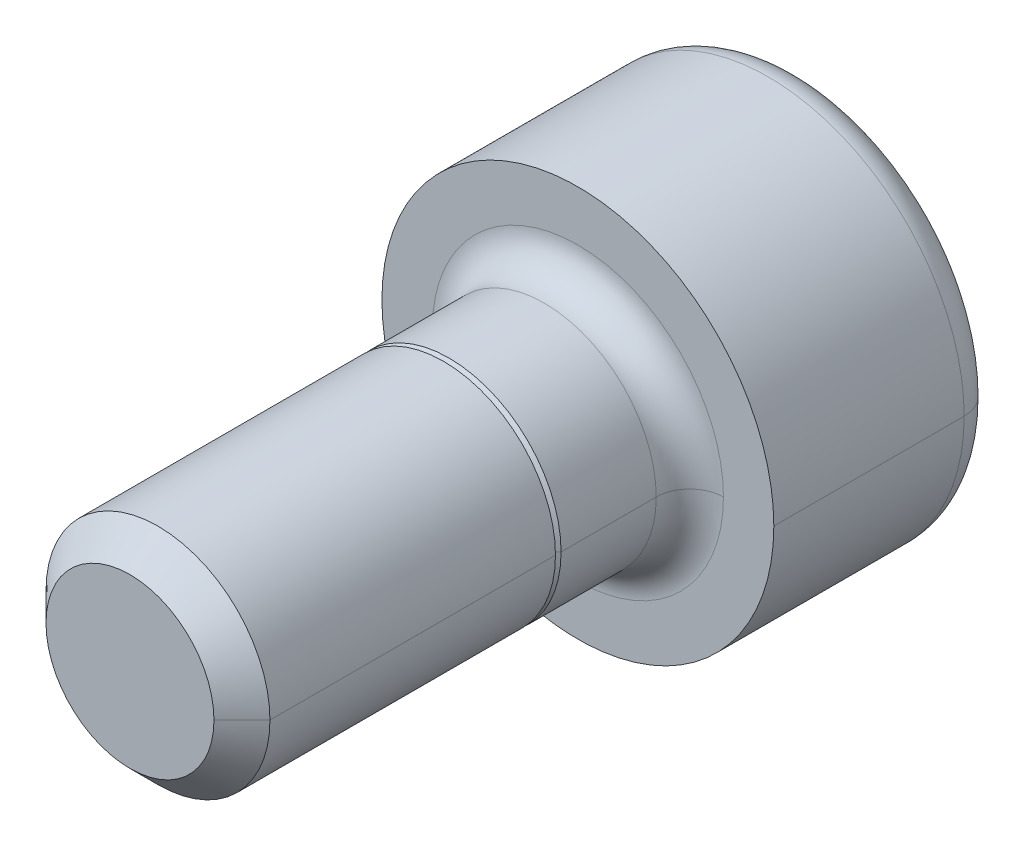
ISO-10303-21;
HEADER;
FILE_DESCRIPTION(('STEP AP214'),'2;1');
FILE_NAME('part.step','',(''),(''),'','','');
FILE_SCHEMA(('AUTOMOTIVE_DESIGN { 1 0 10303 214 1 1 1 1 }'));
ENDSEC;
DATA;
#1=APPLICATION_CONTEXT('core data for automotive mechanical design processes');
#2=APPLICATION_PROTOCOL_DEFINITION('international standard','automotive_design',2000,#1);
#3=PRODUCT_CONTEXT('',#1,'mechanical');
#4=PRODUCT('Part','Part','',(#3));
#5=PRODUCT_RELATED_PRODUCT_CATEGORY('part','',(#4));
#6=PRODUCT_DEFINITION_FORMATION('','',#4);
#7=PRODUCT_DEFINITION_CONTEXT('part definition',#1,'design');
#8=PRODUCT_DEFINITION('design','',#6,#7);
#9=PRODUCT_DEFINITION_SHAPE('','',#8);
#10=(LENGTH_UNIT() NAMED_UNIT(*) SI_UNIT(.MILLI.,.METRE.));
#11=(NAMED_UNIT(*) PLANE_ANGLE_UNIT() SI_UNIT($,.RADIAN.));
#12=(NAMED_UNIT(*) SI_UNIT($,.STERADIAN.) SOLID_ANGLE_UNIT());
#13=UNCERTAINTY_MEASURE_WITH_UNIT(LENGTH_MEASURE(1.E-05),#10,'distance_accuracy_value','');
#14=(GEOMETRIC_REPRESENTATION_CONTEXT(3) GLOBAL_UNCERTAINTY_ASSIGNED_CONTEXT((#13)) GLOBAL_UNIT_ASSIGNED_CONTEXT((#10,
#11,#12)) REPRESENTATION_CONTEXT('',''));
#15=CARTESIAN_POINT('',(0.,0.,0.));
#16=DIRECTION('',(0.,0.,1.));
#17=DIRECTION('',(1.,0.,0.));
#18=AXIS2_PLACEMENT_3D('',#15,#16,#17);
#19=CARTESIAN_POINT('',(0.,0.,-3.4));
#20=DIRECTION('',(0.,0.,1.));
#21=DIRECTION('',(1.,0.,0.));
#22=AXIS2_PLACEMENT_3D('',#19,#20,#21);
#23=TOROIDAL_SURFACE('',#22,2.9,0.6);
#24=CARTESIAN_POINT('',(-2.9,0.,-3.4));
#25=DIRECTION('',(0.,1.,0.));
#26=DIRECTION('',(-1.,0.,0.));
#27=AXIS2_PLACEMENT_3D('',#24,#25,#26);
#28=CIRCLE('',#27,0.6);
#29=CARTESIAN_POINT('',(-2.9,0.,-4.));
#30=VERTEX_POINT('',#29);
#31=CARTESIAN_POINT('',(-3.5,0.,-3.4));
#32=VERTEX_POINT('',#31);
#33=EDGE_CURVE('E181',#30,#32,#28,.T.);
#34=ORIENTED_EDGE('',*,*,#33,.F.);
#35=CARTESIAN_POINT('',(0.,0.,-4.));
#36=DIRECTION('',(0.,0.,-1.));
#37=DIRECTION('',(1.,0.,0.));
#38=AXIS2_PLACEMENT_3D('',#35,#36,#37);
#39=CIRCLE('',#38,2.9);
#40=CARTESIAN_POINT('',(2.9,0.,-4.));
#41=VERTEX_POINT('',#40);
#42=EDGE_CURVE('E168',#41,#30,#39,.T.);
#43=ORIENTED_EDGE('',*,*,#42,.F.);
#44=CARTESIAN_POINT('',(2.9,0.,-3.4));
#45=DIRECTION('',(0.,-1.,0.));
#46=DIRECTION('',(0.,0.,-1.));
#47=AXIS2_PLACEMENT_3D('',#44,#45,#46);
#48=CIRCLE('',#47,0.6);
#49=CARTESIAN_POINT('',(3.5,0.,-3.4));
#50=VERTEX_POINT('',#49);
#51=EDGE_CURVE('E190',#41,#50,#48,.T.);
#52=ORIENTED_EDGE('',*,*,#51,.T.);
#53=CARTESIAN_POINT('',(0.,0.,-3.4));
#54=DIRECTION('',(0.,0.,1.));
#55=DIRECTION('',(1.,0.,0.));
#56=AXIS2_PLACEMENT_3D('',#53,#54,#55);
#57=CIRCLE('',#56,3.5);
#58=EDGE_CURVE('E182',#32,#50,#57,.T.);
#59=ORIENTED_EDGE('',*,*,#58,.F.);
#60=EDGE_LOOP('',(#34,#43,#52,#59));
#61=FACE_BOUND('',#60,.T.);
#62=ADVANCED_FACE('F17',(#61),#23,.T.);
#63=CARTESIAN_POINT('',(0.,0.,0.6));
#64=DIRECTION('',(0.,0.,1.));
#65=DIRECTION('',(1.,0.,0.));
#66=AXIS2_PLACEMENT_3D('',#63,#64,#65);
#67=TOROIDAL_SURFACE('',#66,2.6,0.6);
#68=CARTESIAN_POINT('',(-2.6,0.,0.6));
#69=DIRECTION('',(0.,1.,0.));
#70=DIRECTION('',(-1.,0.,0.));
#71=AXIS2_PLACEMENT_3D('',#68,#69,#70);
#72=CIRCLE('',#71,0.6);
#73=CARTESIAN_POINT('',(-2.,0.,0.6));
#74=VERTEX_POINT('',#73);
#75=CARTESIAN_POINT('',(-2.6,0.,0.));
#76=VERTEX_POINT('',#75);
#77=EDGE_CURVE('E197',#74,#76,#72,.T.);
#78=ORIENTED_EDGE('',*,*,#77,.F.);
#79=CARTESIAN_POINT('',(0.,0.,0.6));
#80=DIRECTION('',(0.,0.,1.));
#81=DIRECTION('',(1.,0.,0.));
#82=AXIS2_PLACEMENT_3D('',#79,#80,#81);
#83=CIRCLE('',#82,2.);
#84=CARTESIAN_POINT('',(2.,0.,0.6));
#85=VERTEX_POINT('',#84);
#86=EDGE_CURVE('E271',#85,#74,#83,.T.);
#87=ORIENTED_EDGE('',*,*,#86,.F.);
#88=CARTESIAN_POINT('',(2.6,0.,0.6));
#89=DIRECTION('',(0.,-1.,0.));
#90=DIRECTION('',(0.,0.,-1.));
#91=AXIS2_PLACEMENT_3D('',#88,#89,#90);
#92=CIRCLE('',#91,0.6);
#93=CARTESIAN_POINT('',(2.6,0.,0.));
#94=VERTEX_POINT('',#93);
#95=EDGE_CURVE('E225',#85,#94,#92,.T.);
#96=ORIENTED_EDGE('',*,*,#95,.T.);
#97=CARTESIAN_POINT('',(0.,0.,0.));
#98=DIRECTION('',(0.,0.,-1.));
#99=DIRECTION('',(1.,0.,0.));
#100=AXIS2_PLACEMENT_3D('',#97,#98,#99);
#101=CIRCLE('',#100,2.6);
#102=EDGE_CURVE('E331',#76,#94,#101,.T.);
#103=ORIENTED_EDGE('',*,*,#102,.F.);
#104=EDGE_LOOP('',(#78,#87,#96,#103));
#105=FACE_BOUND('',#104,.T.);
#106=ADVANCED_FACE('F384',(#105),#67,.F.);
#107=CARTESIAN_POINT('',(0.,0.,8.));
#108=DIRECTION('',(0.,0.,-1.));
#109=DIRECTION('',(-1.,0.,0.));
#110=AXIS2_PLACEMENT_3D('',#107,#108,#109);
#111=CONICAL_SURFACE('',#110,1.5,0.785398163397446);
#112=DIRECTION('',(0.707106781186546,0.,-0.707106781186549));
#113=VECTOR('',#112,1.);
#114=CARTESIAN_POINT('',(1.5,0.,8.));
#115=LINE('',#114,#113);
#116=CARTESIAN_POINT('',(1.5,0.,8.));
#117=VERTEX_POINT('',#116);
#118=CARTESIAN_POINT('',(2.,0.,7.5));
#119=VERTEX_POINT('',#118);
#120=EDGE_CURVE('E242',#117,#119,#115,.T.);
#121=ORIENTED_EDGE('',*,*,#120,.F.);
#122=CARTESIAN_POINT('',(0.,0.,8.));
#123=DIRECTION('',(0.,0.,1.));
#124=DIRECTION('',(1.,0.,0.));
#125=AXIS2_PLACEMENT_3D('',#122,#123,#124);
#126=CIRCLE('',#125,1.5);
#127=CARTESIAN_POINT('',(-1.5,0.,8.));
#128=VERTEX_POINT('',#127);
#129=EDGE_CURVE('E11',#128,#117,#126,.T.);
#130=ORIENTED_EDGE('',*,*,#129,.F.);
#131=DIRECTION('',(-0.707106781186546,0.,-0.707106781186549));
#132=VECTOR('',#131,1.);
#133=CARTESIAN_POINT('',(-1.5,0.,8.));
#134=LINE('',#133,#132);
#135=CARTESIAN_POINT('',(-2.,0.,7.5));
#136=VERTEX_POINT('',#135);
#137=EDGE_CURVE('E233',#128,#136,#134,.T.);
#138=ORIENTED_EDGE('',*,*,#137,.T.);
#139=CARTESIAN_POINT('',(0.,0.,7.5));
#140=DIRECTION('',(0.,0.,-1.));
#141=DIRECTION('',(1.,0.,0.));
#142=AXIS2_PLACEMENT_3D('',#139,#140,#141);
#143=CIRCLE('',#142,2.);
#144=EDGE_CURVE('E274',#119,#136,#143,.T.);
#145=ORIENTED_EDGE('',*,*,#144,.F.);
#146=EDGE_LOOP('',(#121,#130,#138,#145));
#147=FACE_BOUND('',#146,.T.);
#148=ADVANCED_FACE('F413',(#147),#111,.T.);
#149=CARTESIAN_POINT('',(0.,0.,2.4));
#150=DIRECTION('',(0.,0.,1.));
#151=DIRECTION('',(1.,0.,0.));
#152=AXIS2_PLACEMENT_3D('',#149,#150,#151);
#153=PLANE('',#152);
#154=CARTESIAN_POINT('',(0.,0.,2.4));
#155=DIRECTION('',(0.,0.,1.));
#156=DIRECTION('',(1.,0.,0.));
#157=AXIS2_PLACEMENT_3D('',#154,#155,#156);
#158=CIRCLE('',#157,1.9);
#159=CARTESIAN_POINT('',(-1.9,0.,2.4));
#160=VERTEX_POINT('',#159);
#161=CARTESIAN_POINT('',(1.9,0.,2.4));
#162=VERTEX_POINT('',#161);
#163=EDGE_CURVE('E297',#160,#162,#158,.T.);
#164=ORIENTED_EDGE('',*,*,#163,.T.);
#165=CARTESIAN_POINT('',(0.,0.,2.4));
#166=DIRECTION('',(0.,0.,1.));
#167=DIRECTION('',(1.,0.,0.));
#168=AXIS2_PLACEMENT_3D('',#165,#166,#167);
#169=CIRCLE('',#168,1.9);
#170=EDGE_CURVE('E209',#162,#160,#169,.T.);
#171=ORIENTED_EDGE('',*,*,#170,.T.);
#172=EDGE_LOOP('',(#164,#171));
#173=FACE_BOUND('',#172,.T.);
#174=CARTESIAN_POINT('',(0.,0.,2.4));
#175=DIRECTION('',(0.,0.,1.));
#176=DIRECTION('',(1.,0.,0.));
#177=AXIS2_PLACEMENT_3D('',#174,#175,#176);
#178=CIRCLE('',#177,2.);
#179=CARTESIAN_POINT('',(-2.,0.,2.4));
#180=VERTEX_POINT('',#179);
#181=CARTESIAN_POINT('',(2.,0.,2.4));
#182=VERTEX_POINT('',#181);
#183=EDGE_CURVE('E25',#180,#182,#178,.T.);
#184=ORIENTED_EDGE('',*,*,#183,.F.);
#185=CARTESIAN_POINT('',(0.,0.,2.4));
#186=DIRECTION('',(0.,0.,1.));
#187=DIRECTION('',(1.,0.,0.));
#188=AXIS2_PLACEMENT_3D('',#185,#186,#187);
#189=CIRCLE('',#188,2.);
#190=EDGE_CURVE('E217',#182,#180,#189,.T.);
#191=ORIENTED_EDGE('',*,*,#190,.F.);
#192=EDGE_LOOP('',(#184,#191));
#193=FACE_BOUND('',#192,.T.);
#194=ADVANCED_FACE('F362',(#173,#193),#153,.F.);
#195=CARTESIAN_POINT('',(0.,0.,8.));
#196=DIRECTION('',(0.,0.,1.));
#197=DIRECTION('',(1.,0.,0.));
#198=AXIS2_PLACEMENT_3D('',#195,#196,#197);
#199=PLANE('',#198);
#200=ORIENTED_EDGE('',*,*,#129,.T.);
#201=CARTESIAN_POINT('',(0.,0.,8.));
#202=DIRECTION('',(0.,0.,1.));
#203=DIRECTION('',(1.,0.,0.));
#204=AXIS2_PLACEMENT_3D('',#201,#202,#203);
#205=CIRCLE('',#204,1.5);
#206=EDGE_CURVE('E229',#117,#128,#205,.T.);
#207=ORIENTED_EDGE('',*,*,#206,.T.);
#208=EDGE_LOOP('',(#200,#207));
#209=FACE_BOUND('',#208,.T.);
#210=ADVANCED_FACE('F422',(#209),#199,.T.);
#211=CARTESIAN_POINT('',(0.,0.,8.));
#212=DIRECTION('',(0.,0.,-1.));
#213=DIRECTION('',(-1.,0.,0.));
#214=AXIS2_PLACEMENT_3D('',#211,#212,#213);
#215=CYLINDRICAL_SURFACE('',#214,2.);
#216=DIRECTION('',(0.,0.,-1.));
#217=VECTOR('',#216,1.);
#218=CARTESIAN_POINT('',(2.,0.,8.));
#219=LINE('',#218,#217);
#220=EDGE_CURVE('E221',#119,#182,#219,.T.);
#221=ORIENTED_EDGE('',*,*,#220,.F.);
#222=ORIENTED_EDGE('',*,*,#144,.T.);
#223=DIRECTION('',(0.,0.,-1.));
#224=VECTOR('',#223,1.);
#225=CARTESIAN_POINT('',(-2.,0.,8.));
#226=LINE('',#225,#224);
#227=EDGE_CURVE('E214',#136,#180,#226,.T.);
#228=ORIENTED_EDGE('',*,*,#227,.T.);
#229=ORIENTED_EDGE('',*,*,#183,.T.);
#230=EDGE_LOOP('',(#221,#222,#228,#229));
#231=FACE_BOUND('',#230,.T.);
#232=ADVANCED_FACE('F425',(#231),#215,.T.);
#233=CARTESIAN_POINT('',(0.,0.,2.4));
#234=DIRECTION('',(0.,0.,-1.));
#235=DIRECTION('',(-1.,0.,0.));
#236=AXIS2_PLACEMENT_3D('',#233,#234,#235);
#237=CONICAL_SURFACE('',#236,1.9,0.785398163397448);
#238=DIRECTION('',(0.707106781186548,0.,-0.707106781186548));
#239=VECTOR('',#238,1.);
#240=CARTESIAN_POINT('',(1.9,0.,2.4));
#241=LINE('',#240,#239);
#242=CARTESIAN_POINT('',(2.,0.,2.3));
#243=VERTEX_POINT('',#242);
#244=EDGE_CURVE('E213',#162,#243,#241,.T.);
#245=ORIENTED_EDGE('',*,*,#244,.F.);
#246=ORIENTED_EDGE('',*,*,#163,.F.);
#247=DIRECTION('',(-0.707106781186548,0.,-0.707106781186548));
#248=VECTOR('',#247,1.);
#249=CARTESIAN_POINT('',(-1.9,0.,2.4));
#250=LINE('',#249,#248);
#251=CARTESIAN_POINT('',(-2.,0.,2.3));
#252=VERTEX_POINT('',#251);
#253=EDGE_CURVE('E263',#160,#252,#250,.T.);
#254=ORIENTED_EDGE('',*,*,#253,.T.);
#255=CARTESIAN_POINT('',(0.,0.,2.3));
#256=DIRECTION('',(0.,0.,-1.));
#257=DIRECTION('',(1.,0.,0.));
#258=AXIS2_PLACEMENT_3D('',#255,#256,#257);
#259=CIRCLE('',#258,2.);
#260=EDGE_CURVE('E300',#243,#252,#259,.T.);
#261=ORIENTED_EDGE('',*,*,#260,.F.);
#262=EDGE_LOOP('',(#245,#246,#254,#261));
#263=FACE_BOUND('',#262,.T.);
#264=ADVANCED_FACE('F367',(#263),#237,.T.);
#265=CARTESIAN_POINT('',(0.,0.,2.4));
#266=DIRECTION('',(0.,0.,-1.));
#267=DIRECTION('',(-1.,0.,0.));
#268=AXIS2_PLACEMENT_3D('',#265,#266,#267);
#269=CYLINDRICAL_SURFACE('',#268,2.);
#270=DIRECTION('',(0.,0.,-1.));
#271=VECTOR('',#270,1.);
#272=CARTESIAN_POINT('',(2.,0.,2.4));
#273=LINE('',#272,#271);
#274=EDGE_CURVE('E267',#243,#85,#273,.T.);
#275=ORIENTED_EDGE('',*,*,#274,.F.);
#276=ORIENTED_EDGE('',*,*,#260,.T.);
#277=DIRECTION('',(0.,0.,-1.));
#278=VECTOR('',#277,1.);
#279=CARTESIAN_POINT('',(-2.,0.,2.4));
#280=LINE('',#279,#278);
#281=EDGE_CURVE('E278',#252,#74,#280,.T.);
#282=ORIENTED_EDGE('',*,*,#281,.T.);
#283=CARTESIAN_POINT('',(0.,0.,0.6));
#284=DIRECTION('',(0.,0.,1.));
#285=DIRECTION('',(1.,0.,0.));
#286=AXIS2_PLACEMENT_3D('',#283,#284,#285);
#287=CIRCLE('',#286,2.);
#288=EDGE_CURVE('E202',#74,#85,#287,.T.);
#289=ORIENTED_EDGE('',*,*,#288,.T.);
#290=EDGE_LOOP('',(#275,#276,#282,#289));
#291=FACE_BOUND('',#290,.T.);
#292=ADVANCED_FACE('F378',(#291),#269,.T.);
#293=CARTESIAN_POINT('',(0.,0.,-1.5));
#294=DIRECTION('',(0.,0.,-1.));
#295=DIRECTION('',(0.,-1.,0.));
#296=AXIS2_PLACEMENT_3D('',#293,#294,#295);
#297=PLANE('',#296);
#298=DIRECTION('',(-0.5,-0.866025403784439,0.));
#299=VECTOR('',#298,1.);
#300=CARTESIAN_POINT('',(1.73205080756888,0.,-1.5));
#301=LINE('',#300,#299);
#302=CARTESIAN_POINT('',(1.73205080756888,0.,-1.5));
#303=VERTEX_POINT('',#302);
#304=CARTESIAN_POINT('',(0.866025403784438,-1.5,-1.5));
#305=VERTEX_POINT('',#304);
#306=EDGE_CURVE('E234',#303,#305,#301,.T.);
#307=ORIENTED_EDGE('',*,*,#306,.T.);
#308=DIRECTION('',(-1.,0.,0.));
#309=VECTOR('',#308,1.);
#310=CARTESIAN_POINT('',(0.866025403784438,-1.5,-1.5));
#311=LINE('',#310,#309);
#312=CARTESIAN_POINT('',(-0.866025403784439,-1.5,-1.5));
#313=VERTEX_POINT('',#312);
#314=EDGE_CURVE('E38',#305,#313,#311,.T.);
#315=ORIENTED_EDGE('',*,*,#314,.T.);
#316=DIRECTION('',(-0.5,0.866025403784439,0.));
#317=VECTOR('',#316,1.);
#318=CARTESIAN_POINT('',(-0.866025403784439,-1.5,-1.5));
#319=LINE('',#318,#317);
#320=CARTESIAN_POINT('',(-1.73205080756888,0.,-1.5));
#321=VERTEX_POINT('',#320);
#322=EDGE_CURVE('E46',#313,#321,#319,.T.);
#323=ORIENTED_EDGE('',*,*,#322,.T.);
#324=DIRECTION('',(0.5,0.866025403784439,0.));
#325=VECTOR('',#324,1.);
#326=CARTESIAN_POINT('',(-1.73205080756888,0.,-1.5));
#327=LINE('',#326,#325);
#328=CARTESIAN_POINT('',(-0.866025403784439,1.5,-1.5));
#329=VERTEX_POINT('',#328);
#330=EDGE_CURVE('E311',#321,#329,#327,.T.);
#331=ORIENTED_EDGE('',*,*,#330,.T.);
#332=DIRECTION('',(1.,0.,0.));
#333=VECTOR('',#332,1.);
#334=CARTESIAN_POINT('',(-0.866025403784439,1.5,-1.5));
#335=LINE('',#334,#333);
#336=CARTESIAN_POINT('',(0.86602540378444,1.5,-1.5));
#337=VERTEX_POINT('',#336);
#338=EDGE_CURVE('E346',#329,#337,#335,.T.);
#339=ORIENTED_EDGE('',*,*,#338,.T.);
#340=DIRECTION('',(0.5,-0.866025403784439,0.));
#341=VECTOR('',#340,1.);
#342=CARTESIAN_POINT('',(0.86602540378444,1.5,-1.5));
#343=LINE('',#342,#341);
#344=EDGE_CURVE('E340',#337,#303,#343,.T.);
#345=ORIENTED_EDGE('',*,*,#344,.T.);
#346=EDGE_LOOP('',(#307,#315,#323,#331,#339,#345));
#347=FACE_BOUND('',#346,.T.);
#348=ADVANCED_FACE('F432',(#347),#297,.T.);
#349=CARTESIAN_POINT('',(0.866025403784438,-1.5,-1.5));
#350=DIRECTION('',(0.,-1.,0.));
#351=DIRECTION('',(-1.,0.,0.));
#352=AXIS2_PLACEMENT_3D('',#349,#350,#351);
#353=PLANE('',#352);
#354=DIRECTION('',(-1.,0.,0.));
#355=VECTOR('',#354,1.);
#356=CARTESIAN_POINT('',(0.866025403784438,-1.5,-4.));
#357=LINE('',#356,#355);
#358=CARTESIAN_POINT('',(0.866025403784438,-1.5,-4.));
#359=VERTEX_POINT('',#358);
#360=CARTESIAN_POINT('',(-0.866025403784439,-1.5,-4.));
#361=VERTEX_POINT('',#360);
#362=EDGE_CURVE('E177',#359,#361,#357,.T.);
#363=ORIENTED_EDGE('',*,*,#362,.T.);
#364=DIRECTION('',(0.,0.,-1.));
#365=VECTOR('',#364,1.);
#366=CARTESIAN_POINT('',(-0.866025403784439,-1.5,-1.5));
#367=LINE('',#366,#365);
#368=EDGE_CURVE('E301',#313,#361,#367,.T.);
#369=ORIENTED_EDGE('',*,*,#368,.F.);
#370=ORIENTED_EDGE('',*,*,#314,.F.);
#371=DIRECTION('',(0.,0.,-1.));
#372=VECTOR('',#371,1.);
#373=CARTESIAN_POINT('',(0.866025403784438,-1.5,-1.5));
#374=LINE('',#373,#372);
#375=EDGE_CURVE('E238',#305,#359,#374,.T.);
#376=ORIENTED_EDGE('',*,*,#375,.T.);
#377=EDGE_LOOP('',(#363,#369,#370,#376));
#378=FACE_BOUND('',#377,.T.);
#379=ADVANCED_FACE('F435',(#378),#353,.F.);
#380=CARTESIAN_POINT('',(-0.866025403784439,-1.5,-1.5));
#381=DIRECTION('',(-0.866025403784439,-0.5,0.));
#382=DIRECTION('',(-0.5,0.866025403784439,0.));
#383=AXIS2_PLACEMENT_3D('',#380,#381,#382);
#384=PLANE('',#383);
#385=DIRECTION('',(-0.5,0.866025403784439,0.));
#386=VECTOR('',#385,1.);
#387=CARTESIAN_POINT('',(-0.866025403784439,-1.5,-4.));
#388=LINE('',#387,#386);
#389=CARTESIAN_POINT('',(-1.73205080756888,0.,-4.));
#390=VERTEX_POINT('',#389);
#391=EDGE_CURVE('E327',#361,#390,#388,.T.);
#392=ORIENTED_EDGE('',*,*,#391,.T.);
#393=DIRECTION('',(0.,0.,-1.));
#394=VECTOR('',#393,1.);
#395=CARTESIAN_POINT('',(-1.73205080756888,0.,-1.5));
#396=LINE('',#395,#394);
#397=EDGE_CURVE('E309',#321,#390,#396,.T.);
#398=ORIENTED_EDGE('',*,*,#397,.F.);
#399=ORIENTED_EDGE('',*,*,#322,.F.);
#400=ORIENTED_EDGE('',*,*,#368,.T.);
#401=EDGE_LOOP('',(#392,#398,#399,#400));
#402=FACE_BOUND('',#401,.T.);
#403=ADVANCED_FACE('F438',(#402),#384,.F.);
#404=CARTESIAN_POINT('',(-1.73205080756888,0.,-1.5));
#405=DIRECTION('',(-0.866025403784439,0.5,0.));
#406=DIRECTION('',(0.,0.,1.));
#407=AXIS2_PLACEMENT_3D('',#404,#405,#406);
#408=PLANE('',#407);
#409=DIRECTION('',(0.5,0.866025403784439,0.));
#410=VECTOR('',#409,1.);
#411=CARTESIAN_POINT('',(-1.73205080756888,0.,-4.));
#412=LINE('',#411,#410);
#413=CARTESIAN_POINT('',(-0.866025403784439,1.5,-4.));
#414=VERTEX_POINT('',#413);
#415=EDGE_CURVE('E323',#390,#414,#412,.T.);
#416=ORIENTED_EDGE('',*,*,#415,.T.);
#417=DIRECTION('',(0.,0.,-1.));
#418=VECTOR('',#417,1.);
#419=CARTESIAN_POINT('',(-0.866025403784439,1.5,-1.5));
#420=LINE('',#419,#418);
#421=EDGE_CURVE('E349',#329,#414,#420,.T.);
#422=ORIENTED_EDGE('',*,*,#421,.F.);
#423=ORIENTED_EDGE('',*,*,#330,.F.);
#424=ORIENTED_EDGE('',*,*,#397,.T.);
#425=EDGE_LOOP('',(#416,#422,#423,#424));
#426=FACE_BOUND('',#425,.T.);
#427=ADVANCED_FACE('F440',(#426),#408,.F.);
#428=CARTESIAN_POINT('',(-0.866025403784439,1.5,-1.5));
#429=DIRECTION('',(0.,1.,0.));
#430=DIRECTION('',(1.,0.,0.));
#431=AXIS2_PLACEMENT_3D('',#428,#429,#430);
#432=PLANE('',#431);
#433=DIRECTION('',(1.,0.,0.));
#434=VECTOR('',#433,1.);
#435=CARTESIAN_POINT('',(-0.866025403784439,1.5,-4.));
#436=LINE('',#435,#434);
#437=CARTESIAN_POINT('',(0.86602540378444,1.5,-4.));
#438=VERTEX_POINT('',#437);
#439=EDGE_CURVE('E319',#414,#438,#436,.T.);
#440=ORIENTED_EDGE('',*,*,#439,.T.);
#441=DIRECTION('',(0.,0.,-1.));
#442=VECTOR('',#441,1.);
#443=CARTESIAN_POINT('',(0.86602540378444,1.5,-1.5));
#444=LINE('',#443,#442);
#445=EDGE_CURVE('E343',#337,#438,#444,.T.);
#446=ORIENTED_EDGE('',*,*,#445,.F.);
#447=ORIENTED_EDGE('',*,*,#338,.F.);
#448=ORIENTED_EDGE('',*,*,#421,.T.);
#449=EDGE_LOOP('',(#440,#446,#447,#448));
#450=FACE_BOUND('',#449,.T.);
#451=ADVANCED_FACE('F443',(#450),#432,.F.);
#452=CARTESIAN_POINT('',(0.86602540378444,1.5,-1.5));
#453=DIRECTION('',(0.866025403784439,0.5,0.));
#454=DIRECTION('',(0.,0.,-1.));
#455=AXIS2_PLACEMENT_3D('',#452,#453,#454);
#456=PLANE('',#455);
#457=DIRECTION('',(0.5,-0.866025403784439,0.));
#458=VECTOR('',#457,1.);
#459=CARTESIAN_POINT('',(0.86602540378444,1.5,-4.));
#460=LINE('',#459,#458);
#461=CARTESIAN_POINT('',(1.73205080756888,0.,-4.));
#462=VERTEX_POINT('',#461);
#463=EDGE_CURVE('E306',#438,#462,#460,.T.);
#464=ORIENTED_EDGE('',*,*,#463,.T.);
#465=DIRECTION('',(0.,0.,-1.));
#466=VECTOR('',#465,1.);
#467=CARTESIAN_POINT('',(1.73205080756888,0.,-1.5));
#468=LINE('',#467,#466);
#469=EDGE_CURVE('E237',#303,#462,#468,.T.);
#470=ORIENTED_EDGE('',*,*,#469,.F.);
#471=ORIENTED_EDGE('',*,*,#344,.F.);
#472=ORIENTED_EDGE('',*,*,#445,.T.);
#473=EDGE_LOOP('',(#464,#470,#471,#472));
#474=FACE_BOUND('',#473,.T.);
#475=ADVANCED_FACE('F447',(#474),#456,.F.);
#476=CARTESIAN_POINT('',(1.73205080756888,0.,-1.5));
#477=DIRECTION('',(0.866025403784439,-0.5,0.));
#478=DIRECTION('',(0.,0.,-1.));
#479=AXIS2_PLACEMENT_3D('',#476,#477,#478);
#480=PLANE('',#479);
#481=DIRECTION('',(-0.5,-0.866025403784439,0.));
#482=VECTOR('',#481,1.);
#483=CARTESIAN_POINT('',(1.73205080756888,0.,-4.));
#484=LINE('',#483,#482);
#485=EDGE_CURVE('E302',#462,#359,#484,.T.);
#486=ORIENTED_EDGE('',*,*,#485,.T.);
#487=ORIENTED_EDGE('',*,*,#375,.F.);
#488=ORIENTED_EDGE('',*,*,#306,.F.);
#489=ORIENTED_EDGE('',*,*,#469,.T.);
#490=EDGE_LOOP('',(#486,#487,#488,#489));
#491=FACE_BOUND('',#490,.T.);
#492=ADVANCED_FACE('F389',(#491),#480,.F.);
#493=CARTESIAN_POINT('',(0.,0.,0.));
#494=DIRECTION('',(0.,0.,1.));
#495=DIRECTION('',(1.,0.,0.));
#496=AXIS2_PLACEMENT_3D('',#493,#494,#495);
#497=PLANE('',#496);
#498=CARTESIAN_POINT('',(0.,0.,0.));
#499=DIRECTION('',(0.,0.,-1.));
#500=DIRECTION('',(1.,0.,0.));
#501=AXIS2_PLACEMENT_3D('',#498,#499,#500);
#502=CIRCLE('',#501,2.6);
#503=EDGE_CURVE('E201',#94,#76,#502,.T.);
#504=ORIENTED_EDGE('',*,*,#503,.T.);
#505=ORIENTED_EDGE('',*,*,#102,.T.);
#506=EDGE_LOOP('',(#504,#505));
#507=FACE_BOUND('',#506,.T.);
#508=CARTESIAN_POINT('',(0.,0.,0.));
#509=DIRECTION('',(0.,0.,1.));
#510=DIRECTION('',(1.,0.,0.));
#511=AXIS2_PLACEMENT_3D('',#508,#509,#510);
#512=CIRCLE('',#511,3.5);
#513=CARTESIAN_POINT('',(3.5,0.,0.));
#514=VERTEX_POINT('',#513);
#515=CARTESIAN_POINT('',(-3.5,0.,0.));
#516=VERTEX_POINT('',#515);
#517=EDGE_CURVE('E285',#514,#516,#512,.T.);
#518=ORIENTED_EDGE('',*,*,#517,.T.);
#519=CARTESIAN_POINT('',(0.,0.,0.));
#520=DIRECTION('',(0.,0.,1.));
#521=DIRECTION('',(1.,0.,0.));
#522=AXIS2_PLACEMENT_3D('',#519,#520,#521);
#523=CIRCLE('',#522,3.5);
#524=EDGE_CURVE('E178',#516,#514,#523,.T.);
#525=ORIENTED_EDGE('',*,*,#524,.T.);
#526=EDGE_LOOP('',(#518,#525));
#527=FACE_BOUND('',#526,.T.);
#528=ADVANCED_FACE('F386',(#507,#527),#497,.T.);
#529=CARTESIAN_POINT('',(0.,0.,-4.));
#530=DIRECTION('',(0.,0.,1.));
#531=DIRECTION('',(1.,0.,0.));
#532=AXIS2_PLACEMENT_3D('',#529,#530,#531);
#533=PLANE('',#532);
#534=ORIENTED_EDGE('',*,*,#362,.F.);
#535=ORIENTED_EDGE('',*,*,#485,.F.);
#536=ORIENTED_EDGE('',*,*,#463,.F.);
#537=ORIENTED_EDGE('',*,*,#439,.F.);
#538=ORIENTED_EDGE('',*,*,#415,.F.);
#539=ORIENTED_EDGE('',*,*,#391,.F.);
#540=EDGE_LOOP('',(#534,#535,#536,#537,#538,#539));
#541=FACE_BOUND('',#540,.T.);
#542=ORIENTED_EDGE('',*,*,#42,.T.);
#543=CARTESIAN_POINT('',(0.,0.,-4.));
#544=DIRECTION('',(0.,0.,-1.));
#545=DIRECTION('',(1.,0.,0.));
#546=AXIS2_PLACEMENT_3D('',#543,#544,#545);
#547=CIRCLE('',#546,2.9);
#548=EDGE_CURVE('E172',#30,#41,#547,.T.);
#549=ORIENTED_EDGE('',*,*,#548,.T.);
#550=EDGE_LOOP('',(#542,#549));
#551=FACE_BOUND('',#550,.T.);
#552=ADVANCED_FACE('F170',(#541,#551),#533,.F.);
#553=CARTESIAN_POINT('',(0.,0.,-4.));
#554=DIRECTION('',(0.,0.,1.));
#555=DIRECTION('',(1.,0.,0.));
#556=AXIS2_PLACEMENT_3D('',#553,#554,#555);
#557=CYLINDRICAL_SURFACE('',#556,3.5);
#558=DIRECTION('',(0.,0.,1.));
#559=VECTOR('',#558,1.);
#560=CARTESIAN_POINT('',(-3.5,0.,-4.));
#561=LINE('',#560,#559);
#562=EDGE_CURVE('E281',#32,#516,#561,.T.);
#563=ORIENTED_EDGE('',*,*,#562,.F.);
#564=ORIENTED_EDGE('',*,*,#58,.T.);
#565=DIRECTION('',(0.,0.,1.));
#566=VECTOR('',#565,1.);
#567=CARTESIAN_POINT('',(3.5,0.,-4.));
#568=LINE('',#567,#566);
#569=EDGE_CURVE('E289',#50,#514,#568,.T.);
#570=ORIENTED_EDGE('',*,*,#569,.T.);
#571=ORIENTED_EDGE('',*,*,#524,.F.);
#572=EDGE_LOOP('',(#563,#564,#570,#571));
#573=FACE_BOUND('',#572,.T.);
#574=ADVANCED_FACE('F396',(#573),#557,.T.);
#575=CARTESIAN_POINT('',(0.,0.,-4.));
#576=DIRECTION('',(0.,0.,1.));
#577=DIRECTION('',(1.,0.,0.));
#578=AXIS2_PLACEMENT_3D('',#575,#576,#577);
#579=CYLINDRICAL_SURFACE('',#578,3.5);
#580=CARTESIAN_POINT('',(0.,0.,-3.4));
#581=DIRECTION('',(0.,0.,1.));
#582=DIRECTION('',(1.,0.,0.));
#583=AXIS2_PLACEMENT_3D('',#580,#581,#582);
#584=CIRCLE('',#583,3.5);
#585=EDGE_CURVE('E187',#50,#32,#584,.T.);
#586=ORIENTED_EDGE('',*,*,#585,.T.);
#587=ORIENTED_EDGE('',*,*,#562,.T.);
#588=ORIENTED_EDGE('',*,*,#517,.F.);
#589=ORIENTED_EDGE('',*,*,#569,.F.);
#590=EDGE_LOOP('',(#586,#587,#588,#589));
#591=FACE_BOUND('',#590,.T.);
#592=ADVANCED_FACE('F394',(#591),#579,.T.);
#593=CARTESIAN_POINT('',(0.,0.,2.4));
#594=DIRECTION('',(0.,0.,-1.));
#595=DIRECTION('',(-1.,0.,0.));
#596=AXIS2_PLACEMENT_3D('',#593,#594,#595);
#597=CYLINDRICAL_SURFACE('',#596,2.);
#598=CARTESIAN_POINT('',(0.,0.,2.3));
#599=DIRECTION('',(0.,0.,-1.));
#600=DIRECTION('',(1.,0.,0.));
#601=AXIS2_PLACEMENT_3D('',#598,#599,#600);
#602=CIRCLE('',#601,2.);
#603=EDGE_CURVE('E259',#252,#243,#602,.T.);
#604=ORIENTED_EDGE('',*,*,#603,.T.);
#605=ORIENTED_EDGE('',*,*,#274,.T.);
#606=ORIENTED_EDGE('',*,*,#86,.T.);
#607=ORIENTED_EDGE('',*,*,#281,.F.);
#608=EDGE_LOOP('',(#604,#605,#606,#607));
#609=FACE_BOUND('',#608,.T.);
#610=ADVANCED_FACE('F374',(#609),#597,.T.);
#611=CARTESIAN_POINT('',(0.,0.,2.4));
#612=DIRECTION('',(0.,0.,-1.));
#613=DIRECTION('',(-1.,0.,0.));
#614=AXIS2_PLACEMENT_3D('',#611,#612,#613);
#615=CONICAL_SURFACE('',#614,1.9,0.785398163397448);
#616=ORIENTED_EDGE('',*,*,#170,.F.);
#617=ORIENTED_EDGE('',*,*,#244,.T.);
#618=ORIENTED_EDGE('',*,*,#603,.F.);
#619=ORIENTED_EDGE('',*,*,#253,.F.);
#620=EDGE_LOOP('',(#616,#617,#618,#619));
#621=FACE_BOUND('',#620,.T.);
#622=ADVANCED_FACE('F371',(#621),#615,.T.);
#623=CARTESIAN_POINT('',(0.,0.,8.));
#624=DIRECTION('',(0.,0.,-1.));
#625=DIRECTION('',(-1.,0.,0.));
#626=AXIS2_PLACEMENT_3D('',#623,#624,#625);
#627=CYLINDRICAL_SURFACE('',#626,2.);
#628=CARTESIAN_POINT('',(0.,0.,7.5));
#629=DIRECTION('',(0.,0.,-1.));
#630=DIRECTION('',(1.,0.,0.));
#631=AXIS2_PLACEMENT_3D('',#628,#629,#630);
#632=CIRCLE('',#631,2.);
#633=EDGE_CURVE('E249',#136,#119,#632,.T.);
#634=ORIENTED_EDGE('',*,*,#633,.T.);
#635=ORIENTED_EDGE('',*,*,#220,.T.);
#636=ORIENTED_EDGE('',*,*,#190,.T.);
#637=ORIENTED_EDGE('',*,*,#227,.F.);
#638=EDGE_LOOP('',(#634,#635,#636,#637));
#639=FACE_BOUND('',#638,.T.);
#640=ADVANCED_FACE('F454',(#639),#627,.T.);
#641=CARTESIAN_POINT('',(0.,0.,8.));
#642=DIRECTION('',(0.,0.,-1.));
#643=DIRECTION('',(-1.,0.,0.));
#644=AXIS2_PLACEMENT_3D('',#641,#642,#643);
#645=CONICAL_SURFACE('',#644,1.5,0.785398163397446);
#646=ORIENTED_EDGE('',*,*,#206,.F.);
#647=ORIENTED_EDGE('',*,*,#120,.T.);
#648=ORIENTED_EDGE('',*,*,#633,.F.);
#649=ORIENTED_EDGE('',*,*,#137,.F.);
#650=EDGE_LOOP('',(#646,#647,#648,#649));
#651=FACE_BOUND('',#650,.T.);
#652=ADVANCED_FACE('F457',(#651),#645,.T.);
#653=CARTESIAN_POINT('',(0.,0.,0.6));
#654=DIRECTION('',(0.,0.,1.));
#655=DIRECTION('',(1.,0.,0.));
#656=AXIS2_PLACEMENT_3D('',#653,#654,#655);
#657=TOROIDAL_SURFACE('',#656,2.6,0.6);
#658=ORIENTED_EDGE('',*,*,#288,.F.);
#659=ORIENTED_EDGE('',*,*,#77,.T.);
#660=ORIENTED_EDGE('',*,*,#503,.F.);
#661=ORIENTED_EDGE('',*,*,#95,.F.);
#662=EDGE_LOOP('',(#658,#659,#660,#661));
#663=FACE_BOUND('',#662,.T.);
#664=ADVANCED_FACE('F381',(#663),#657,.F.);
#665=CARTESIAN_POINT('',(0.,0.,-3.4));
#666=DIRECTION('',(0.,0.,1.));
#667=DIRECTION('',(1.,0.,0.));
#668=AXIS2_PLACEMENT_3D('',#665,#666,#667);
#669=TOROIDAL_SURFACE('',#668,2.9,0.6);
#670=ORIENTED_EDGE('',*,*,#548,.F.);
#671=ORIENTED_EDGE('',*,*,#33,.T.);
#672=ORIENTED_EDGE('',*,*,#585,.F.);
#673=ORIENTED_EDGE('',*,*,#51,.F.);
#674=EDGE_LOOP('',(#670,#671,#672,#673));
#675=FACE_BOUND('',#674,.T.);
#676=ADVANCED_FACE('F189',(#675),#669,.T.);
#677=CLOSED_SHELL('',(#62,#106,#148,#194,#210,#232,#264,#292,#348,#379,#403,#427,#451,#475,#492,
#528,#552,#574,#592,#610,#622,#640,#652,#664,#676));
#678=MANIFOLD_SOLID_BREP('B1',#677);
#679=ADVANCED_BREP_SHAPE_REPRESENTATION('',(#18,#678),#14);
#680=SHAPE_DEFINITION_REPRESENTATION(#9,#679);
ENDSEC;
END-ISO-10303-21;
